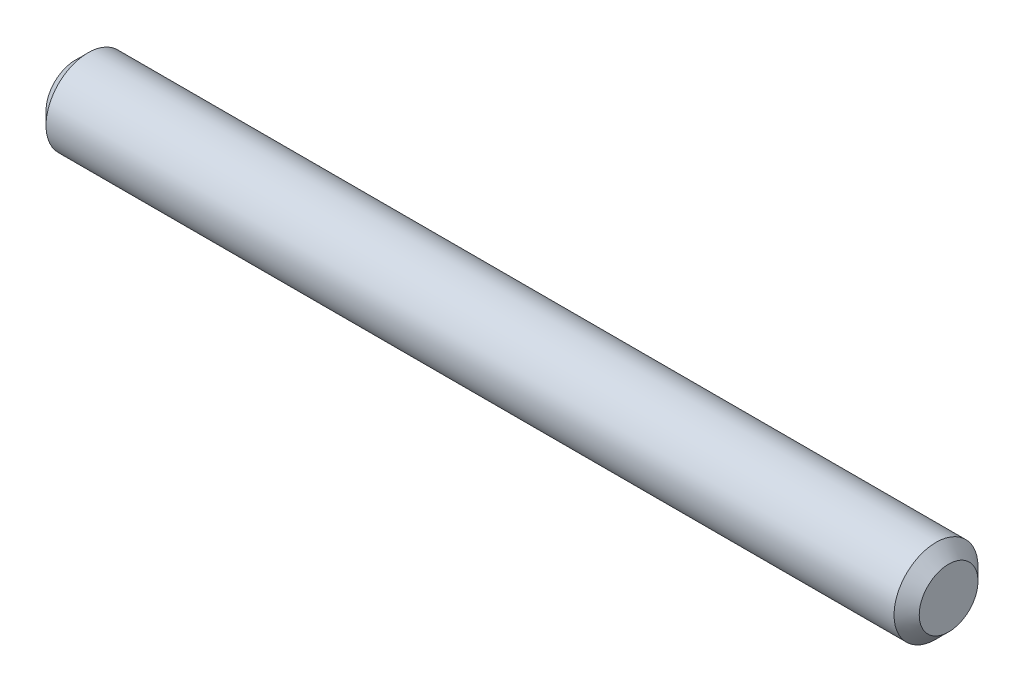
ISO-10303-21;
HEADER;
FILE_DESCRIPTION(('STEP AP214'),'2;1');
FILE_NAME('part.step','',(''),(''),'','','');
FILE_SCHEMA(('AUTOMOTIVE_DESIGN { 1 0 10303 214 1 1 1 1 }'));
ENDSEC;
DATA;
#1=APPLICATION_CONTEXT('core data for automotive mechanical design processes');
#2=APPLICATION_PROTOCOL_DEFINITION('international standard','automotive_design',2000,#1);
#3=PRODUCT_CONTEXT('',#1,'mechanical');
#4=PRODUCT('Part','Part','',(#3));
#5=PRODUCT_RELATED_PRODUCT_CATEGORY('part','',(#4));
#6=PRODUCT_DEFINITION_FORMATION('','',#4);
#7=PRODUCT_DEFINITION_CONTEXT('part definition',#1,'design');
#8=PRODUCT_DEFINITION('design','',#6,#7);
#9=PRODUCT_DEFINITION_SHAPE('','',#8);
#10=(LENGTH_UNIT() NAMED_UNIT(*) SI_UNIT(.MILLI.,.METRE.));
#11=(NAMED_UNIT(*) PLANE_ANGLE_UNIT() SI_UNIT($,.RADIAN.));
#12=(NAMED_UNIT(*) SI_UNIT($,.STERADIAN.) SOLID_ANGLE_UNIT());
#13=UNCERTAINTY_MEASURE_WITH_UNIT(LENGTH_MEASURE(1.E-05),#10,'distance_accuracy_value','');
#14=(GEOMETRIC_REPRESENTATION_CONTEXT(3) GLOBAL_UNCERTAINTY_ASSIGNED_CONTEXT((#13)) GLOBAL_UNIT_ASSIGNED_CONTEXT((#10,
#11,#12)) REPRESENTATION_CONTEXT('',''));
#15=CARTESIAN_POINT('',(0.,0.,0.));
#16=DIRECTION('',(0.,0.,1.));
#17=DIRECTION('',(1.,0.,0.));
#18=AXIS2_PLACEMENT_3D('',#15,#16,#17);
#19=CARTESIAN_POINT('',(-10.4,0.,0.));
#20=DIRECTION('',(1.,0.,0.));
#21=DIRECTION('',(0.,0.,-1.));
#22=AXIS2_PLACEMENT_3D('',#19,#20,#21);
#23=PLANE('',#22);
#24=CARTESIAN_POINT('',(-10.4000000000042,0.,0.));
#25=DIRECTION('',(1.,0.,0.));
#26=DIRECTION('',(0.,0.,-1.));
#27=AXIS2_PLACEMENT_3D('',#24,#25,#26);
#28=CIRCLE('',#27,0.699991334101923);
#29=CARTESIAN_POINT('',(-10.4000000000042,0.,-0.699991334101923));
#30=VERTEX_POINT('',#29);
#31=EDGE_CURVE('E17',#30,#30,#28,.T.);
#32=ORIENTED_EDGE('',*,*,#31,.F.);
#33=EDGE_LOOP('',(#32));
#34=FACE_BOUND('',#33,.T.);
#35=ADVANCED_FACE('F14',(#34),#23,.F.);
#36=CARTESIAN_POINT('',(10.4,0.,0.));
#37=DIRECTION('',(1.,0.,0.));
#38=DIRECTION('',(0.,0.,-1.));
#39=AXIS2_PLACEMENT_3D('',#36,#37,#38);
#40=PLANE('',#39);
#41=CARTESIAN_POINT('',(10.4000000000042,0.,0.));
#42=DIRECTION('',(-1.,0.,0.));
#43=DIRECTION('',(0.,0.,1.));
#44=AXIS2_PLACEMENT_3D('',#41,#42,#43);
#45=CIRCLE('',#44,0.699991334101923);
#46=CARTESIAN_POINT('',(10.4000000000042,0.,0.699991334101923));
#47=VERTEX_POINT('',#46);
#48=EDGE_CURVE('E26',#47,#47,#45,.T.);
#49=ORIENTED_EDGE('',*,*,#48,.F.);
#50=EDGE_LOOP('',(#49));
#51=FACE_BOUND('',#50,.T.);
#52=ADVANCED_FACE('F37',(#51),#40,.T.);
#53=CARTESIAN_POINT('',(-10.0999876200945,0.,0.));
#54=DIRECTION('',(1.,0.,0.));
#55=DIRECTION('',(0.,0.,-1.));
#56=AXIS2_PLACEMENT_3D('',#53,#54,#55);
#57=CONICAL_SURFACE('',#56,0.99999999991951,0.785391973460994);
#58=CARTESIAN_POINT('',(-10.0999876200055,0.,0.));
#59=DIRECTION('',(1.,0.,0.));
#60=DIRECTION('',(0.,0.,-1.));
#61=AXIS2_PLACEMENT_3D('',#58,#59,#60);
#62=CIRCLE('',#61,1.);
#63=CARTESIAN_POINT('',(-10.0999876200055,0.,-1.));
#64=VERTEX_POINT('',#63);
#65=EDGE_CURVE('E21',#64,#64,#62,.T.);
#66=ORIENTED_EDGE('',*,*,#65,.F.);
#67=EDGE_LOOP('',(#66));
#68=FACE_BOUND('',#67,.T.);
#69=ORIENTED_EDGE('',*,*,#31,.T.);
#70=EDGE_LOOP('',(#69));
#71=FACE_BOUND('',#70,.T.);
#72=ADVANCED_FACE('F34',(#68,#71),#57,.T.);
#73=CARTESIAN_POINT('',(10.0999876200945,0.,0.));
#74=DIRECTION('',(-1.,0.,0.));
#75=DIRECTION('',(0.,0.,1.));
#76=AXIS2_PLACEMENT_3D('',#73,#74,#75);
#77=CONICAL_SURFACE('',#76,0.99999999991951,0.785391973460994);
#78=CARTESIAN_POINT('',(10.0999876200055,0.,0.));
#79=DIRECTION('',(1.,0.,0.));
#80=DIRECTION('',(0.,0.,-1.));
#81=AXIS2_PLACEMENT_3D('',#78,#79,#80);
#82=CIRCLE('',#81,1.);
#83=CARTESIAN_POINT('',(10.0999876200055,0.,-1.));
#84=VERTEX_POINT('',#83);
#85=EDGE_CURVE('E10',#84,#84,#82,.F.);
#86=ORIENTED_EDGE('',*,*,#85,.F.);
#87=EDGE_LOOP('',(#86));
#88=FACE_BOUND('',#87,.T.);
#89=ORIENTED_EDGE('',*,*,#48,.T.);
#90=EDGE_LOOP('',(#89));
#91=FACE_BOUND('',#90,.T.);
#92=ADVANCED_FACE('F45',(#88,#91),#77,.T.);
#93=CARTESIAN_POINT('',(-10.4,0.,0.));
#94=DIRECTION('',(1.,0.,0.));
#95=DIRECTION('',(0.,0.,-1.));
#96=AXIS2_PLACEMENT_3D('',#93,#94,#95);
#97=CYLINDRICAL_SURFACE('',#96,1.);
#98=ORIENTED_EDGE('',*,*,#85,.T.);
#99=EDGE_LOOP('',(#98));
#100=FACE_BOUND('',#99,.T.);
#101=ORIENTED_EDGE('',*,*,#65,.T.);
#102=EDGE_LOOP('',(#101));
#103=FACE_BOUND('',#102,.T.);
#104=ADVANCED_FACE('F43',(#100,#103),#97,.T.);
#105=CLOSED_SHELL('',(#35,#52,#72,#92,#104));
#106=MANIFOLD_SOLID_BREP('B1',#105);
#107=ADVANCED_BREP_SHAPE_REPRESENTATION('',(#18,#106),#14);
#108=SHAPE_DEFINITION_REPRESENTATION(#9,#107);
ENDSEC;
END-ISO-10303-21;
